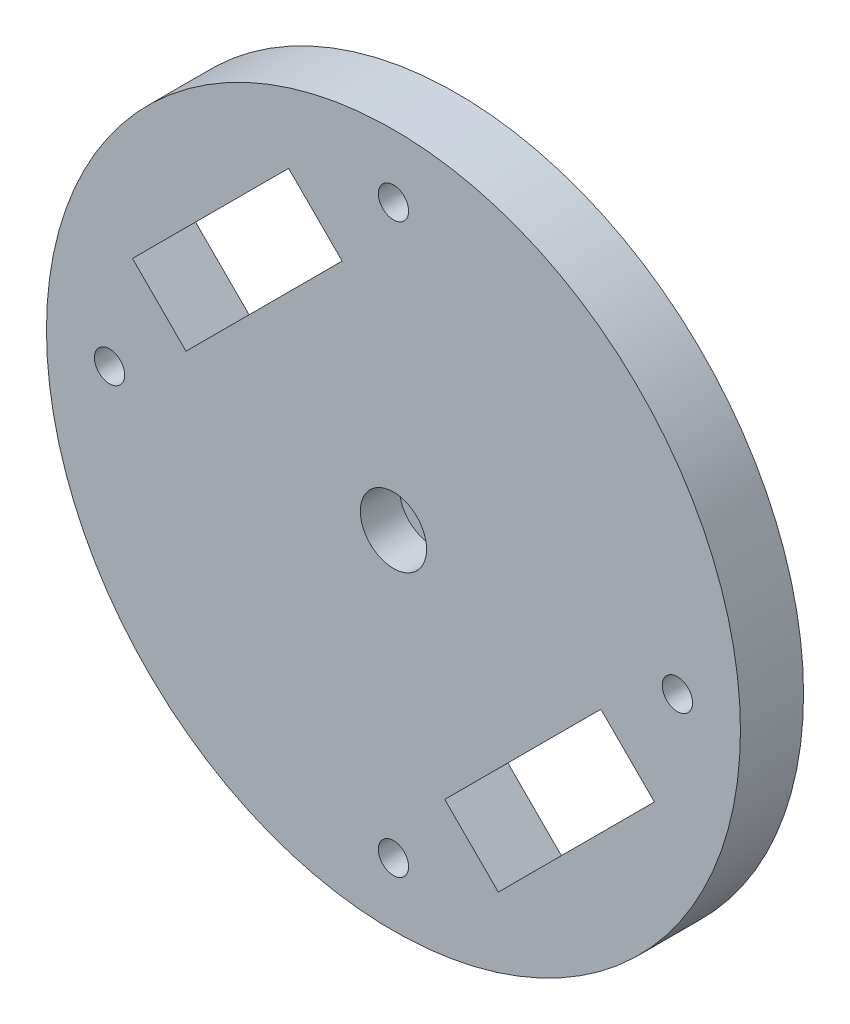
ISO-10303-21;
HEADER;
FILE_DESCRIPTION(('STEP AP214'),'2;1');
FILE_NAME('part.step','',(''),(''),'','','');
FILE_SCHEMA(('AUTOMOTIVE_DESIGN { 1 0 10303 214 1 1 1 1 }'));
ENDSEC;
DATA;
#1=APPLICATION_CONTEXT('core data for automotive mechanical design processes');
#2=APPLICATION_PROTOCOL_DEFINITION('international standard','automotive_design',2000,#1);
#3=PRODUCT_CONTEXT('',#1,'mechanical');
#4=PRODUCT('Part','Part','',(#3));
#5=PRODUCT_RELATED_PRODUCT_CATEGORY('part','',(#4));
#6=PRODUCT_DEFINITION_FORMATION('','',#4);
#7=PRODUCT_DEFINITION_CONTEXT('part definition',#1,'design');
#8=PRODUCT_DEFINITION('design','',#6,#7);
#9=PRODUCT_DEFINITION_SHAPE('','',#8);
#10=(LENGTH_UNIT() NAMED_UNIT(*) SI_UNIT(.MILLI.,.METRE.));
#11=(NAMED_UNIT(*) PLANE_ANGLE_UNIT() SI_UNIT($,.RADIAN.));
#12=(NAMED_UNIT(*) SI_UNIT($,.STERADIAN.) SOLID_ANGLE_UNIT());
#13=UNCERTAINTY_MEASURE_WITH_UNIT(LENGTH_MEASURE(1.E-05),#10,'distance_accuracy_value','');
#14=(GEOMETRIC_REPRESENTATION_CONTEXT(3) GLOBAL_UNCERTAINTY_ASSIGNED_CONTEXT((#13)) GLOBAL_UNIT_ASSIGNED_CONTEXT((#10,
#11,#12)) REPRESENTATION_CONTEXT('',''));
#15=CARTESIAN_POINT('',(0.,0.,0.));
#16=DIRECTION('',(0.,0.,1.));
#17=DIRECTION('',(1.,0.,0.));
#18=AXIS2_PLACEMENT_3D('',#15,#16,#17);
#19=CARTESIAN_POINT('',(0.,0.,44.05));
#20=DIRECTION('',(0.,0.,1.));
#21=DIRECTION('',(1.,0.,0.));
#22=AXIS2_PLACEMENT_3D('',#19,#20,#21);
#23=PLANE('',#22);
#24=CARTESIAN_POINT('',(0.,0.,44.05));
#25=DIRECTION('',(0.,0.,1.));
#26=DIRECTION('',(1.,0.,0.));
#27=AXIS2_PLACEMENT_3D('',#24,#25,#26);
#28=CIRCLE('',#27,3.);
#29=CARTESIAN_POINT('',(3.,0.,44.05));
#30=VERTEX_POINT('',#29);
#31=EDGE_CURVE('E146',#30,#30,#28,.T.);
#32=ORIENTED_EDGE('',*,*,#31,.T.);
#33=EDGE_LOOP('',(#32));
#34=FACE_BOUND('',#33,.T.);
#35=CARTESIAN_POINT('',(0.,0.,44.05));
#36=DIRECTION('',(0.,0.,1.));
#37=DIRECTION('',(1.,0.,0.));
#38=AXIS2_PLACEMENT_3D('',#35,#36,#37);
#39=CIRCLE('',#38,11.25);
#40=CARTESIAN_POINT('',(11.25,0.,44.05));
#41=VERTEX_POINT('',#40);
#42=EDGE_CURVE('E46',#41,#41,#39,.T.);
#43=ORIENTED_EDGE('',*,*,#42,.F.);
#44=EDGE_LOOP('',(#43));
#45=FACE_BOUND('',#44,.T.);
#46=ADVANCED_FACE('F38',(#34,#45),#23,.F.);
#47=CARTESIAN_POINT('',(0.,0.,59.05));
#48=DIRECTION('',(0.,0.,-1.));
#49=DIRECTION('',(-1.,0.,0.));
#50=AXIS2_PLACEMENT_3D('',#47,#48,#49);
#51=CYLINDRICAL_SURFACE('',#50,55.);
#52=CARTESIAN_POINT('',(0.,0.,59.05));
#53=DIRECTION('',(0.,0.,1.));
#54=DIRECTION('',(1.,0.,0.));
#55=AXIS2_PLACEMENT_3D('',#52,#53,#54);
#56=CIRCLE('',#55,55.);
#57=CARTESIAN_POINT('',(55.,0.,59.05));
#58=VERTEX_POINT('',#57);
#59=EDGE_CURVE('E197',#58,#58,#56,.T.);
#60=ORIENTED_EDGE('',*,*,#59,.F.);
#61=EDGE_LOOP('',(#60));
#62=FACE_BOUND('',#61,.T.);
#63=CARTESIAN_POINT('',(0.,0.,49.05));
#64=DIRECTION('',(0.,0.,1.));
#65=DIRECTION('',(1.,0.,0.));
#66=AXIS2_PLACEMENT_3D('',#63,#64,#65);
#67=CIRCLE('',#66,55.);
#68=CARTESIAN_POINT('',(55.,0.,49.05));
#69=VERTEX_POINT('',#68);
#70=EDGE_CURVE('E196',#69,#69,#67,.T.);
#71=ORIENTED_EDGE('',*,*,#70,.T.);
#72=EDGE_LOOP('',(#71));
#73=FACE_BOUND('',#72,.T.);
#74=ADVANCED_FACE('F207',(#62,#73),#51,.T.);
#75=CARTESIAN_POINT('',(0.,0.,59.05));
#76=DIRECTION('',(0.,0.,1.));
#77=DIRECTION('',(1.,0.,0.));
#78=AXIS2_PLACEMENT_3D('',#75,#76,#77);
#79=PLANE('',#78);
#80=CARTESIAN_POINT('',(0.,0.,59.05));
#81=DIRECTION('',(0.,0.,1.));
#82=DIRECTION('',(1.,0.,0.));
#83=AXIS2_PLACEMENT_3D('',#80,#81,#82);
#84=CIRCLE('',#83,5.25);
#85=CARTESIAN_POINT('',(5.25,0.,59.05));
#86=VERTEX_POINT('',#85);
#87=EDGE_CURVE('E284',#86,#86,#84,.T.);
#88=ORIENTED_EDGE('',*,*,#87,.F.);
#89=EDGE_LOOP('',(#88));
#90=FACE_BOUND('',#89,.T.);
#91=DIRECTION('',(-0.707106781186546,0.707106781186549,0.));
#92=VECTOR('',#91,1.);
#93=CARTESIAN_POINT('',(-16.6170093578839,41.3657466994132,59.05));
#94=LINE('',#93,#92);
#95=CARTESIAN_POINT('',(-8.13172798364536,32.8804653251746,59.05));
#96=VERTEX_POINT('',#95);
#97=CARTESIAN_POINT('',(-16.6170093578839,41.3657466994132,59.05));
#98=VERTEX_POINT('',#97);
#99=EDGE_CURVE('E53',#96,#98,#94,.T.);
#100=ORIENTED_EDGE('',*,*,#99,.F.);
#101=DIRECTION('',(0.707106781186549,0.707106781186546,0.));
#102=VECTOR('',#101,1.);
#103=CARTESIAN_POINT('',(-32.8804653251746,8.13172798364545,59.05));
#104=LINE('',#103,#102);
#105=CARTESIAN_POINT('',(-32.8804653251746,8.13172798364545,59.05));
#106=VERTEX_POINT('',#105);
#107=EDGE_CURVE('E111',#106,#96,#104,.T.);
#108=ORIENTED_EDGE('',*,*,#107,.F.);
#109=DIRECTION('',(0.707106781186546,-0.707106781186549,0.));
#110=VECTOR('',#109,1.);
#111=CARTESIAN_POINT('',(-41.3657466994131,16.617009357884,59.05));
#112=LINE('',#111,#110);
#113=CARTESIAN_POINT('',(-41.3657466994131,16.617009357884,59.05));
#114=VERTEX_POINT('',#113);
#115=EDGE_CURVE('E134',#114,#106,#112,.T.);
#116=ORIENTED_EDGE('',*,*,#115,.F.);
#117=DIRECTION('',(-0.707106781186549,-0.707106781186546,0.));
#118=VECTOR('',#117,1.);
#119=CARTESIAN_POINT('',(-16.6170093578839,41.3657466994132,59.05));
#120=LINE('',#119,#118);
#121=EDGE_CURVE('E127',#98,#114,#120,.T.);
#122=ORIENTED_EDGE('',*,*,#121,.F.);
#123=EDGE_LOOP('',(#100,#108,#116,#122));
#124=FACE_BOUND('',#123,.T.);
#125=DIRECTION('',(-0.707106781186547,0.707106781186548,0.));
#126=VECTOR('',#125,1.);
#127=CARTESIAN_POINT('',(41.3657466994131,-16.617009357884,59.05));
#128=LINE('',#127,#126);
#129=CARTESIAN_POINT('',(41.3657466994131,-16.617009357884,59.05));
#130=VERTEX_POINT('',#129);
#131=CARTESIAN_POINT('',(32.8804653251746,-8.13172798364544,59.05));
#132=VERTEX_POINT('',#131);
#133=EDGE_CURVE('E61',#130,#132,#128,.T.);
#134=ORIENTED_EDGE('',*,*,#133,.F.);
#135=DIRECTION('',(0.707106781186548,0.707106781186547,0.));
#136=VECTOR('',#135,1.);
#137=CARTESIAN_POINT('',(41.3657466994131,-16.617009357884,59.05));
#138=LINE('',#137,#136);
#139=CARTESIAN_POINT('',(16.6170093578839,-41.3657466994131,59.05));
#140=VERTEX_POINT('',#139);
#141=EDGE_CURVE('E159',#140,#130,#138,.T.);
#142=ORIENTED_EDGE('',*,*,#141,.F.);
#143=DIRECTION('',(0.707106781186546,-0.707106781186549,0.));
#144=VECTOR('',#143,1.);
#145=CARTESIAN_POINT('',(16.6170093578839,-41.3657466994131,59.05));
#146=LINE('',#145,#144);
#147=CARTESIAN_POINT('',(8.13172798364535,-32.8804653251746,59.05));
#148=VERTEX_POINT('',#147);
#149=EDGE_CURVE('E156',#148,#140,#146,.T.);
#150=ORIENTED_EDGE('',*,*,#149,.F.);
#151=DIRECTION('',(-0.707106781186549,-0.707106781186546,0.));
#152=VECTOR('',#151,1.);
#153=CARTESIAN_POINT('',(8.13172798364535,-32.8804653251746,59.05));
#154=LINE('',#153,#152);
#155=EDGE_CURVE('E153',#132,#148,#154,.T.);
#156=ORIENTED_EDGE('',*,*,#155,.F.);
#157=EDGE_LOOP('',(#134,#142,#150,#156));
#158=FACE_BOUND('',#157,.T.);
#159=CARTESIAN_POINT('',(0.,45.,59.05));
#160=DIRECTION('',(0.,0.,1.));
#161=DIRECTION('',(1.,0.,0.));
#162=AXIS2_PLACEMENT_3D('',#159,#160,#161);
#163=CIRCLE('',#162,2.39999999999999);
#164=CARTESIAN_POINT('',(2.39999999999999,45.,59.05));
#165=VERTEX_POINT('',#164);
#166=EDGE_CURVE('E119',#165,#165,#163,.T.);
#167=ORIENTED_EDGE('',*,*,#166,.F.);
#168=EDGE_LOOP('',(#167));
#169=FACE_BOUND('',#168,.T.);
#170=CARTESIAN_POINT('',(0.,-45.,59.05));
#171=DIRECTION('',(0.,0.,1.));
#172=DIRECTION('',(1.,0.,0.));
#173=AXIS2_PLACEMENT_3D('',#170,#171,#172);
#174=CIRCLE('',#173,2.39999999999999);
#175=CARTESIAN_POINT('',(2.39999999999999,-45.,59.05));
#176=VERTEX_POINT('',#175);
#177=EDGE_CURVE('E178',#176,#176,#174,.T.);
#178=ORIENTED_EDGE('',*,*,#177,.F.);
#179=EDGE_LOOP('',(#178));
#180=FACE_BOUND('',#179,.T.);
#181=CARTESIAN_POINT('',(45.,0.,59.05));
#182=DIRECTION('',(0.,0.,1.));
#183=DIRECTION('',(1.,0.,0.));
#184=AXIS2_PLACEMENT_3D('',#181,#182,#183);
#185=CIRCLE('',#184,2.39999999999999);
#186=CARTESIAN_POINT('',(47.4,0.,59.05));
#187=VERTEX_POINT('',#186);
#188=EDGE_CURVE('E184',#187,#187,#185,.T.);
#189=ORIENTED_EDGE('',*,*,#188,.F.);
#190=EDGE_LOOP('',(#189));
#191=FACE_BOUND('',#190,.T.);
#192=CARTESIAN_POINT('',(-45.,0.,59.05));
#193=DIRECTION('',(0.,0.,1.));
#194=DIRECTION('',(1.,0.,0.));
#195=AXIS2_PLACEMENT_3D('',#192,#193,#194);
#196=CIRCLE('',#195,2.39999999999999);
#197=CARTESIAN_POINT('',(-42.6,0.,59.05));
#198=VERTEX_POINT('',#197);
#199=EDGE_CURVE('E190',#198,#198,#196,.T.);
#200=ORIENTED_EDGE('',*,*,#199,.F.);
#201=EDGE_LOOP('',(#200));
#202=FACE_BOUND('',#201,.T.);
#203=ORIENTED_EDGE('',*,*,#59,.T.);
#204=EDGE_LOOP('',(#203));
#205=FACE_BOUND('',#204,.T.);
#206=ADVANCED_FACE('F212',(#90,#124,#158,#169,#180,#191,#202,#205),#79,.T.);
#207=CARTESIAN_POINT('',(0.,0.,49.05));
#208=DIRECTION('',(0.,0.,1.));
#209=DIRECTION('',(1.,0.,0.));
#210=AXIS2_PLACEMENT_3D('',#207,#208,#209);
#211=PLANE('',#210);
#212=DIRECTION('',(-0.707106781186549,-0.707106781186546,0.));
#213=VECTOR('',#212,1.);
#214=CARTESIAN_POINT('',(-32.8804653251746,8.13172798364545,49.05));
#215=LINE('',#214,#213);
#216=CARTESIAN_POINT('',(-8.13172798364536,32.8804653251746,49.05));
#217=VERTEX_POINT('',#216);
#218=CARTESIAN_POINT('',(-32.8804653251746,8.13172798364545,49.05));
#219=VERTEX_POINT('',#218);
#220=EDGE_CURVE('E125',#217,#219,#215,.T.);
#221=ORIENTED_EDGE('',*,*,#220,.F.);
#222=DIRECTION('',(0.707106781186546,-0.707106781186549,0.));
#223=VECTOR('',#222,1.);
#224=CARTESIAN_POINT('',(-16.6170093578839,41.3657466994132,49.05));
#225=LINE('',#224,#223);
#226=CARTESIAN_POINT('',(-16.6170093578839,41.3657466994132,49.05));
#227=VERTEX_POINT('',#226);
#228=EDGE_CURVE('E105',#227,#217,#225,.T.);
#229=ORIENTED_EDGE('',*,*,#228,.F.);
#230=DIRECTION('',(0.707106781186549,0.707106781186546,0.));
#231=VECTOR('',#230,1.);
#232=CARTESIAN_POINT('',(-16.6170093578839,41.3657466994132,49.05));
#233=LINE('',#232,#231);
#234=CARTESIAN_POINT('',(-41.3657466994131,16.617009357884,49.05));
#235=VERTEX_POINT('',#234);
#236=EDGE_CURVE('E115',#235,#227,#233,.T.);
#237=ORIENTED_EDGE('',*,*,#236,.F.);
#238=DIRECTION('',(-0.707106781186546,0.707106781186549,0.));
#239=VECTOR('',#238,1.);
#240=CARTESIAN_POINT('',(-41.3657466994131,16.617009357884,49.05));
#241=LINE('',#240,#239);
#242=EDGE_CURVE('E129',#219,#235,#241,.T.);
#243=ORIENTED_EDGE('',*,*,#242,.F.);
#244=EDGE_LOOP('',(#221,#229,#237,#243));
#245=FACE_BOUND('',#244,.T.);
#246=DIRECTION('',(-0.707106781186548,-0.707106781186547,0.));
#247=VECTOR('',#246,1.);
#248=CARTESIAN_POINT('',(41.3657466994131,-16.617009357884,49.05));
#249=LINE('',#248,#247);
#250=CARTESIAN_POINT('',(41.3657466994131,-16.617009357884,49.05));
#251=VERTEX_POINT('',#250);
#252=CARTESIAN_POINT('',(16.6170093578839,-41.3657466994131,49.05));
#253=VERTEX_POINT('',#252);
#254=EDGE_CURVE('E145',#251,#253,#249,.T.);
#255=ORIENTED_EDGE('',*,*,#254,.F.);
#256=DIRECTION('',(0.707106781186547,-0.707106781186548,0.));
#257=VECTOR('',#256,1.);
#258=CARTESIAN_POINT('',(41.3657466994131,-16.617009357884,49.05));
#259=LINE('',#258,#257);
#260=CARTESIAN_POINT('',(32.8804653251746,-8.13172798364544,49.05));
#261=VERTEX_POINT('',#260);
#262=EDGE_CURVE('E149',#261,#251,#259,.T.);
#263=ORIENTED_EDGE('',*,*,#262,.F.);
#264=DIRECTION('',(0.707106781186549,0.707106781186546,0.));
#265=VECTOR('',#264,1.);
#266=CARTESIAN_POINT('',(8.13172798364535,-32.8804653251746,49.05));
#267=LINE('',#266,#265);
#268=CARTESIAN_POINT('',(8.13172798364535,-32.8804653251746,49.05));
#269=VERTEX_POINT('',#268);
#270=EDGE_CURVE('E165',#269,#261,#267,.T.);
#271=ORIENTED_EDGE('',*,*,#270,.F.);
#272=DIRECTION('',(-0.707106781186546,0.707106781186549,0.));
#273=VECTOR('',#272,1.);
#274=CARTESIAN_POINT('',(16.6170093578839,-41.3657466994131,49.05));
#275=LINE('',#274,#273);
#276=EDGE_CURVE('E143',#253,#269,#275,.T.);
#277=ORIENTED_EDGE('',*,*,#276,.F.);
#278=EDGE_LOOP('',(#255,#263,#271,#277));
#279=FACE_BOUND('',#278,.T.);
#280=CARTESIAN_POINT('',(0.,45.,49.05));
#281=DIRECTION('',(0.,0.,1.));
#282=DIRECTION('',(1.,0.,0.));
#283=AXIS2_PLACEMENT_3D('',#280,#281,#282);
#284=CIRCLE('',#283,2.4);
#285=CARTESIAN_POINT('',(2.4,45.,49.05));
#286=VERTEX_POINT('',#285);
#287=EDGE_CURVE('E175',#286,#286,#284,.T.);
#288=ORIENTED_EDGE('',*,*,#287,.T.);
#289=EDGE_LOOP('',(#288));
#290=FACE_BOUND('',#289,.T.);
#291=CARTESIAN_POINT('',(0.,-45.,49.05));
#292=DIRECTION('',(0.,0.,1.));
#293=DIRECTION('',(1.,0.,0.));
#294=AXIS2_PLACEMENT_3D('',#291,#292,#293);
#295=CIRCLE('',#294,2.4);
#296=CARTESIAN_POINT('',(2.4,-45.,49.05));
#297=VERTEX_POINT('',#296);
#298=EDGE_CURVE('E181',#297,#297,#295,.T.);
#299=ORIENTED_EDGE('',*,*,#298,.T.);
#300=EDGE_LOOP('',(#299));
#301=FACE_BOUND('',#300,.T.);
#302=CARTESIAN_POINT('',(45.,0.,49.05));
#303=DIRECTION('',(0.,0.,1.));
#304=DIRECTION('',(1.,0.,0.));
#305=AXIS2_PLACEMENT_3D('',#302,#303,#304);
#306=CIRCLE('',#305,2.4);
#307=CARTESIAN_POINT('',(47.4,0.,49.05));
#308=VERTEX_POINT('',#307);
#309=EDGE_CURVE('E187',#308,#308,#306,.T.);
#310=ORIENTED_EDGE('',*,*,#309,.T.);
#311=EDGE_LOOP('',(#310));
#312=FACE_BOUND('',#311,.T.);
#313=CARTESIAN_POINT('',(-45.,0.,49.05));
#314=DIRECTION('',(0.,0.,1.));
#315=DIRECTION('',(1.,0.,0.));
#316=AXIS2_PLACEMENT_3D('',#313,#314,#315);
#317=CIRCLE('',#316,2.4);
#318=CARTESIAN_POINT('',(-42.6,0.,49.05));
#319=VERTEX_POINT('',#318);
#320=EDGE_CURVE('E193',#319,#319,#317,.T.);
#321=ORIENTED_EDGE('',*,*,#320,.T.);
#322=EDGE_LOOP('',(#321));
#323=FACE_BOUND('',#322,.T.);
#324=CARTESIAN_POINT('',(0.,0.,49.05));
#325=DIRECTION('',(0.,0.,1.));
#326=DIRECTION('',(1.,0.,0.));
#327=AXIS2_PLACEMENT_3D('',#324,#325,#326);
#328=CIRCLE('',#327,16.25);
#329=CARTESIAN_POINT('',(16.25,0.,49.05));
#330=VERTEX_POINT('',#329);
#331=EDGE_CURVE('E11',#330,#330,#328,.T.);
#332=ORIENTED_EDGE('',*,*,#331,.T.);
#333=EDGE_LOOP('',(#332));
#334=FACE_BOUND('',#333,.T.);
#335=ORIENTED_EDGE('',*,*,#70,.F.);
#336=EDGE_LOOP('',(#335));
#337=FACE_BOUND('',#336,.T.);
#338=ADVANCED_FACE('F122',(#245,#279,#290,#301,#312,#323,#334,#337),#211,.F.);
#339=CARTESIAN_POINT('',(0.,0.,44.05));
#340=DIRECTION('',(0.,0.,1.));
#341=DIRECTION('',(1.,0.,0.));
#342=AXIS2_PLACEMENT_3D('',#339,#340,#341);
#343=TOROIDAL_SURFACE('',#342,16.25,5.);
#344=ORIENTED_EDGE('',*,*,#42,.T.);
#345=EDGE_LOOP('',(#344));
#346=FACE_BOUND('',#345,.T.);
#347=ORIENTED_EDGE('',*,*,#331,.F.);
#348=EDGE_LOOP('',(#347));
#349=FACE_BOUND('',#348,.T.);
#350=ADVANCED_FACE('F40',(#346,#349),#343,.F.);
#351=CARTESIAN_POINT('',(-45.,0.,59.05));
#352=DIRECTION('',(0.,0.,1.));
#353=DIRECTION('',(1.,0.,0.));
#354=AXIS2_PLACEMENT_3D('',#351,#352,#353);
#355=CYLINDRICAL_SURFACE('',#354,2.4);
#356=ORIENTED_EDGE('',*,*,#320,.F.);
#357=EDGE_LOOP('',(#356));
#358=FACE_BOUND('',#357,.T.);
#359=ORIENTED_EDGE('',*,*,#199,.T.);
#360=EDGE_LOOP('',(#359));
#361=FACE_BOUND('',#360,.T.);
#362=ADVANCED_FACE('F222',(#358,#361),#355,.F.);
#363=CARTESIAN_POINT('',(45.,0.,59.05));
#364=DIRECTION('',(0.,0.,1.));
#365=DIRECTION('',(1.,0.,0.));
#366=AXIS2_PLACEMENT_3D('',#363,#364,#365);
#367=CYLINDRICAL_SURFACE('',#366,2.4);
#368=ORIENTED_EDGE('',*,*,#309,.F.);
#369=EDGE_LOOP('',(#368));
#370=FACE_BOUND('',#369,.T.);
#371=ORIENTED_EDGE('',*,*,#188,.T.);
#372=EDGE_LOOP('',(#371));
#373=FACE_BOUND('',#372,.T.);
#374=ADVANCED_FACE('F225',(#370,#373),#367,.F.);
#375=CARTESIAN_POINT('',(0.,-45.,59.05));
#376=DIRECTION('',(0.,0.,1.));
#377=DIRECTION('',(1.,0.,0.));
#378=AXIS2_PLACEMENT_3D('',#375,#376,#377);
#379=CYLINDRICAL_SURFACE('',#378,2.4);
#380=ORIENTED_EDGE('',*,*,#298,.F.);
#381=EDGE_LOOP('',(#380));
#382=FACE_BOUND('',#381,.T.);
#383=ORIENTED_EDGE('',*,*,#177,.T.);
#384=EDGE_LOOP('',(#383));
#385=FACE_BOUND('',#384,.T.);
#386=ADVANCED_FACE('F229',(#382,#385),#379,.F.);
#387=CARTESIAN_POINT('',(0.,45.,59.05));
#388=DIRECTION('',(0.,0.,1.));
#389=DIRECTION('',(1.,0.,0.));
#390=AXIS2_PLACEMENT_3D('',#387,#388,#389);
#391=CYLINDRICAL_SURFACE('',#390,2.4);
#392=ORIENTED_EDGE('',*,*,#287,.F.);
#393=EDGE_LOOP('',(#392));
#394=FACE_BOUND('',#393,.T.);
#395=ORIENTED_EDGE('',*,*,#166,.T.);
#396=EDGE_LOOP('',(#395));
#397=FACE_BOUND('',#396,.T.);
#398=ADVANCED_FACE('F233',(#394,#397),#391,.F.);
#399=CARTESIAN_POINT('',(41.3657466994131,-16.617009357884,1.999));
#400=DIRECTION('',(0.707106781186548,0.707106781186547,0.));
#401=DIRECTION('',(-0.707106781186547,0.707106781186548,0.));
#402=AXIS2_PLACEMENT_3D('',#399,#400,#401);
#403=PLANE('',#402);
#404=ORIENTED_EDGE('',*,*,#262,.T.);
#405=DIRECTION('',(0.,0.,1.));
#406=VECTOR('',#405,1.);
#407=CARTESIAN_POINT('',(41.3657466994131,-16.617009357884,1.999));
#408=LINE('',#407,#406);
#409=EDGE_CURVE('E163',#251,#130,#408,.T.);
#410=ORIENTED_EDGE('',*,*,#409,.T.);
#411=ORIENTED_EDGE('',*,*,#133,.T.);
#412=DIRECTION('',(0.,0.,1.));
#413=VECTOR('',#412,1.);
#414=CARTESIAN_POINT('',(32.8804653251746,-8.13172798364544,1.999));
#415=LINE('',#414,#413);
#416=EDGE_CURVE('E162',#261,#132,#415,.T.);
#417=ORIENTED_EDGE('',*,*,#416,.F.);
#418=EDGE_LOOP('',(#404,#410,#411,#417));
#419=FACE_BOUND('',#418,.T.);
#420=ADVANCED_FACE('F237',(#419),#403,.F.);
#421=CARTESIAN_POINT('',(41.3657466994131,-16.617009357884,1.999));
#422=DIRECTION('',(0.707106781186547,-0.707106781186548,0.));
#423=DIRECTION('',(0.707106781186548,0.707106781186547,0.));
#424=AXIS2_PLACEMENT_3D('',#421,#422,#423);
#425=PLANE('',#424);
#426=ORIENTED_EDGE('',*,*,#254,.T.);
#427=DIRECTION('',(0.,0.,1.));
#428=VECTOR('',#427,1.);
#429=CARTESIAN_POINT('',(16.6170093578839,-41.3657466994131,1.999));
#430=LINE('',#429,#428);
#431=EDGE_CURVE('E166',#253,#140,#430,.T.);
#432=ORIENTED_EDGE('',*,*,#431,.T.);
#433=ORIENTED_EDGE('',*,*,#141,.T.);
#434=ORIENTED_EDGE('',*,*,#409,.F.);
#435=EDGE_LOOP('',(#426,#432,#433,#434));
#436=FACE_BOUND('',#435,.T.);
#437=ADVANCED_FACE('F241',(#436),#425,.F.);
#438=CARTESIAN_POINT('',(16.6170093578839,-41.3657466994131,1.999));
#439=DIRECTION('',(-0.707106781186549,-0.707106781186546,0.));
#440=DIRECTION('',(0.707106781186546,-0.707106781186549,0.));
#441=AXIS2_PLACEMENT_3D('',#438,#439,#440);
#442=PLANE('',#441);
#443=ORIENTED_EDGE('',*,*,#276,.T.);
#444=DIRECTION('',(0.,0.,1.));
#445=VECTOR('',#444,1.);
#446=CARTESIAN_POINT('',(8.13172798364535,-32.8804653251746,1.999));
#447=LINE('',#446,#445);
#448=EDGE_CURVE('E168',#269,#148,#447,.T.);
#449=ORIENTED_EDGE('',*,*,#448,.T.);
#450=ORIENTED_EDGE('',*,*,#149,.T.);
#451=ORIENTED_EDGE('',*,*,#431,.F.);
#452=EDGE_LOOP('',(#443,#449,#450,#451));
#453=FACE_BOUND('',#452,.T.);
#454=ADVANCED_FACE('F245',(#453),#442,.F.);
#455=CARTESIAN_POINT('',(8.13172798364535,-32.8804653251746,1.999));
#456=DIRECTION('',(-0.707106781186546,0.707106781186549,0.));
#457=DIRECTION('',(-0.707106781186549,-0.707106781186546,0.));
#458=AXIS2_PLACEMENT_3D('',#455,#456,#457);
#459=PLANE('',#458);
#460=ORIENTED_EDGE('',*,*,#270,.T.);
#461=ORIENTED_EDGE('',*,*,#416,.T.);
#462=ORIENTED_EDGE('',*,*,#155,.T.);
#463=ORIENTED_EDGE('',*,*,#448,.F.);
#464=EDGE_LOOP('',(#460,#461,#462,#463));
#465=FACE_BOUND('',#464,.T.);
#466=ADVANCED_FACE('F242',(#465),#459,.F.);
#467=CARTESIAN_POINT('',(-16.6170093578839,41.3657466994132,1.999));
#468=DIRECTION('',(0.707106781186549,0.707106781186546,0.));
#469=DIRECTION('',(-0.707106781186546,0.707106781186549,0.));
#470=AXIS2_PLACEMENT_3D('',#467,#468,#469);
#471=PLANE('',#470);
#472=ORIENTED_EDGE('',*,*,#228,.T.);
#473=DIRECTION('',(0.,0.,1.));
#474=VECTOR('',#473,1.);
#475=CARTESIAN_POINT('',(-8.13172798364536,32.8804653251746,1.999));
#476=LINE('',#475,#474);
#477=EDGE_CURVE('E120',#217,#96,#476,.T.);
#478=ORIENTED_EDGE('',*,*,#477,.T.);
#479=ORIENTED_EDGE('',*,*,#99,.T.);
#480=DIRECTION('',(0.,0.,1.));
#481=VECTOR('',#480,1.);
#482=CARTESIAN_POINT('',(-16.6170093578839,41.3657466994132,1.999));
#483=LINE('',#482,#481);
#484=EDGE_CURVE('E101',#227,#98,#483,.T.);
#485=ORIENTED_EDGE('',*,*,#484,.F.);
#486=EDGE_LOOP('',(#472,#478,#479,#485));
#487=FACE_BOUND('',#486,.T.);
#488=ADVANCED_FACE('F103',(#487),#471,.F.);
#489=CARTESIAN_POINT('',(-32.8804653251746,8.13172798364545,1.999));
#490=DIRECTION('',(0.707106781186546,-0.707106781186549,0.));
#491=DIRECTION('',(0.707106781186549,0.707106781186546,0.));
#492=AXIS2_PLACEMENT_3D('',#489,#490,#491);
#493=PLANE('',#492);
#494=ORIENTED_EDGE('',*,*,#220,.T.);
#495=DIRECTION('',(0.,0.,1.));
#496=VECTOR('',#495,1.);
#497=CARTESIAN_POINT('',(-32.8804653251746,8.13172798364545,1.999));
#498=LINE('',#497,#496);
#499=EDGE_CURVE('E140',#219,#106,#498,.T.);
#500=ORIENTED_EDGE('',*,*,#499,.T.);
#501=ORIENTED_EDGE('',*,*,#107,.T.);
#502=ORIENTED_EDGE('',*,*,#477,.F.);
#503=EDGE_LOOP('',(#494,#500,#501,#502));
#504=FACE_BOUND('',#503,.T.);
#505=ADVANCED_FACE('F255',(#504),#493,.F.);
#506=CARTESIAN_POINT('',(-41.3657466994131,16.617009357884,1.999));
#507=DIRECTION('',(-0.707106781186549,-0.707106781186546,0.));
#508=DIRECTION('',(0.707106781186546,-0.707106781186549,0.));
#509=AXIS2_PLACEMENT_3D('',#506,#507,#508);
#510=PLANE('',#509);
#511=ORIENTED_EDGE('',*,*,#242,.T.);
#512=DIRECTION('',(0.,0.,1.));
#513=VECTOR('',#512,1.);
#514=CARTESIAN_POINT('',(-41.3657466994131,16.617009357884,1.999));
#515=LINE('',#514,#513);
#516=EDGE_CURVE('E110',#235,#114,#515,.T.);
#517=ORIENTED_EDGE('',*,*,#516,.T.);
#518=ORIENTED_EDGE('',*,*,#115,.T.);
#519=ORIENTED_EDGE('',*,*,#499,.F.);
#520=EDGE_LOOP('',(#511,#517,#518,#519));
#521=FACE_BOUND('',#520,.T.);
#522=ADVANCED_FACE('F259',(#521),#510,.F.);
#523=CARTESIAN_POINT('',(-16.6170093578839,41.3657466994132,1.999));
#524=DIRECTION('',(-0.707106781186546,0.707106781186549,0.));
#525=DIRECTION('',(-0.707106781186549,-0.707106781186546,0.));
#526=AXIS2_PLACEMENT_3D('',#523,#524,#525);
#527=PLANE('',#526);
#528=ORIENTED_EDGE('',*,*,#236,.T.);
#529=ORIENTED_EDGE('',*,*,#484,.T.);
#530=ORIENTED_EDGE('',*,*,#121,.T.);
#531=ORIENTED_EDGE('',*,*,#516,.F.);
#532=EDGE_LOOP('',(#528,#529,#530,#531));
#533=FACE_BOUND('',#532,.T.);
#534=ADVANCED_FACE('F116',(#533),#527,.F.);
#535=CARTESIAN_POINT('',(0.,0.,59.05));
#536=DIRECTION('',(0.,0.,1.));
#537=DIRECTION('',(1.,0.,0.));
#538=AXIS2_PLACEMENT_3D('',#535,#536,#537);
#539=CYLINDRICAL_SURFACE('',#538,3.);
#540=ORIENTED_EDGE('',*,*,#31,.F.);
#541=EDGE_LOOP('',(#540));
#542=FACE_BOUND('',#541,.T.);
#543=CARTESIAN_POINT('',(0.,0.,52.85));
#544=DIRECTION('',(0.,0.,1.));
#545=DIRECTION('',(1.,0.,0.));
#546=AXIS2_PLACEMENT_3D('',#543,#544,#545);
#547=CIRCLE('',#546,3.);
#548=CARTESIAN_POINT('',(3.,0.,52.85));
#549=VERTEX_POINT('',#548);
#550=EDGE_CURVE('E286',#549,#549,#547,.T.);
#551=ORIENTED_EDGE('',*,*,#550,.T.);
#552=EDGE_LOOP('',(#551));
#553=FACE_BOUND('',#552,.T.);
#554=ADVANCED_FACE('F258',(#542,#553),#539,.F.);
#555=CARTESIAN_POINT('',(3.,0.,52.85));
#556=DIRECTION('',(0.,0.,-1.));
#557=DIRECTION('',(-1.,0.,0.));
#558=AXIS2_PLACEMENT_3D('',#555,#556,#557);
#559=PLANE('',#558);
#560=ORIENTED_EDGE('',*,*,#550,.F.);
#561=EDGE_LOOP('',(#560));
#562=FACE_BOUND('',#561,.T.);
#563=CARTESIAN_POINT('',(0.,0.,52.85));
#564=DIRECTION('',(0.,0.,1.));
#565=DIRECTION('',(1.,0.,0.));
#566=AXIS2_PLACEMENT_3D('',#563,#564,#565);
#567=CIRCLE('',#566,5.25);
#568=CARTESIAN_POINT('',(5.25,0.,52.85));
#569=VERTEX_POINT('',#568);
#570=EDGE_CURVE('E281',#569,#569,#567,.T.);
#571=ORIENTED_EDGE('',*,*,#570,.T.);
#572=EDGE_LOOP('',(#571));
#573=FACE_BOUND('',#572,.T.);
#574=ADVANCED_FACE('F268',(#562,#573),#559,.F.);
#575=CARTESIAN_POINT('',(0.,0.,59.05));
#576=DIRECTION('',(0.,0.,1.));
#577=DIRECTION('',(1.,0.,0.));
#578=AXIS2_PLACEMENT_3D('',#575,#576,#577);
#579=CYLINDRICAL_SURFACE('',#578,5.25);
#580=ORIENTED_EDGE('',*,*,#570,.F.);
#581=EDGE_LOOP('',(#580));
#582=FACE_BOUND('',#581,.T.);
#583=ORIENTED_EDGE('',*,*,#87,.T.);
#584=EDGE_LOOP('',(#583));
#585=FACE_BOUND('',#584,.T.);
#586=ADVANCED_FACE('F272',(#582,#585),#579,.F.);
#587=CLOSED_SHELL('',(#46,#74,#206,#338,#350,#362,#374,#386,#398,#420,#437,#454,#466,#488,#505,
#522,#534,#554,#574,#586));
#588=MANIFOLD_SOLID_BREP('B2',#587);
#589=ADVANCED_BREP_SHAPE_REPRESENTATION('',(#18,#588),#14);
#590=SHAPE_DEFINITION_REPRESENTATION(#9,#589);
ENDSEC;
END-ISO-10303-21;
